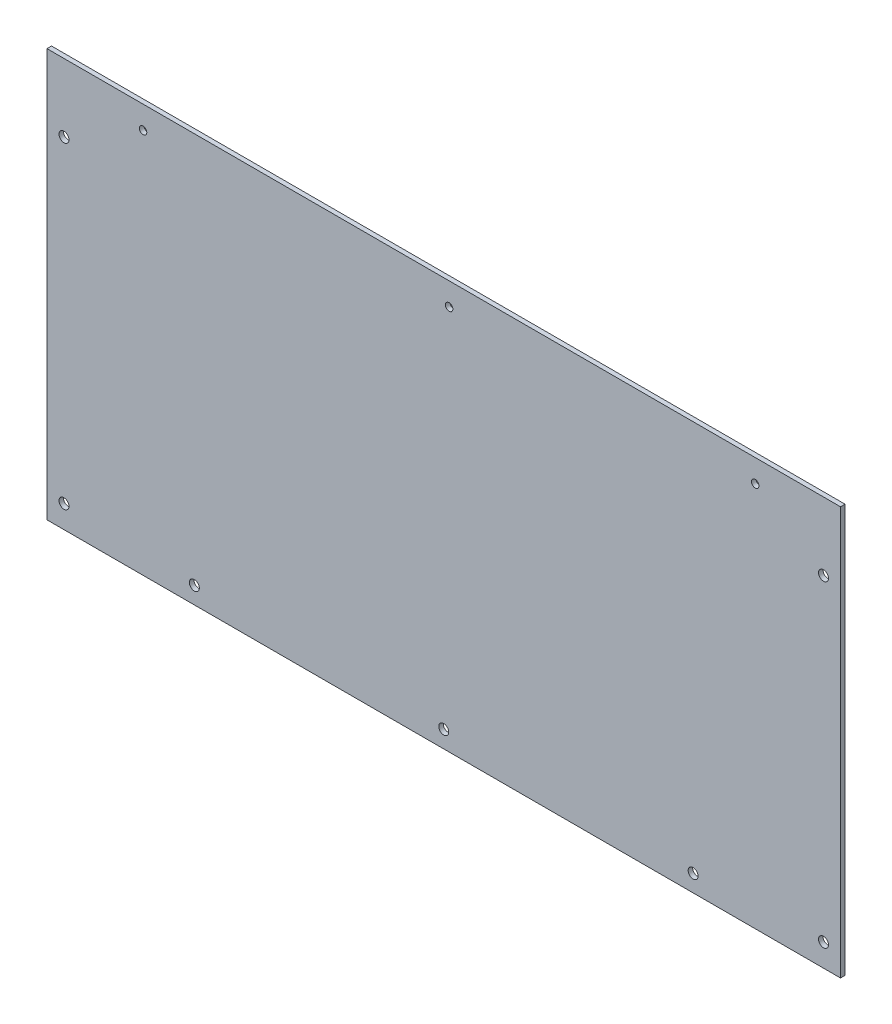
ISO-10303-21;
HEADER;
FILE_DESCRIPTION(('STEP AP214'),'2;1');
FILE_NAME('part.step','',(''),(''),'','','');
FILE_SCHEMA(('AUTOMOTIVE_DESIGN { 1 0 10303 214 1 1 1 1 }'));
ENDSEC;
DATA;
#1=APPLICATION_CONTEXT('core data for automotive mechanical design processes');
#2=APPLICATION_PROTOCOL_DEFINITION('international standard','automotive_design',2000,#1);
#3=PRODUCT_CONTEXT('',#1,'mechanical');
#4=PRODUCT('Part','Part','',(#3));
#5=PRODUCT_RELATED_PRODUCT_CATEGORY('part','',(#4));
#6=PRODUCT_DEFINITION_FORMATION('','',#4);
#7=PRODUCT_DEFINITION_CONTEXT('part definition',#1,'design');
#8=PRODUCT_DEFINITION('design','',#6,#7);
#9=PRODUCT_DEFINITION_SHAPE('','',#8);
#10=(LENGTH_UNIT() NAMED_UNIT(*) SI_UNIT(.MILLI.,.METRE.));
#11=(NAMED_UNIT(*) PLANE_ANGLE_UNIT() SI_UNIT($,.RADIAN.));
#12=(NAMED_UNIT(*) SI_UNIT($,.STERADIAN.) SOLID_ANGLE_UNIT());
#13=UNCERTAINTY_MEASURE_WITH_UNIT(LENGTH_MEASURE(1.E-05),#10,'distance_accuracy_value','');
#14=(GEOMETRIC_REPRESENTATION_CONTEXT(3) GLOBAL_UNCERTAINTY_ASSIGNED_CONTEXT((#13)) GLOBAL_UNIT_ASSIGNED_CONTEXT((#10,
#11,#12)) REPRESENTATION_CONTEXT('',''));
#15=CARTESIAN_POINT('',(0.,0.,0.));
#16=DIRECTION('',(0.,0.,1.));
#17=DIRECTION('',(1.,0.,0.));
#18=AXIS2_PLACEMENT_3D('',#15,#16,#17);
#19=CARTESIAN_POINT('',(175.,90.,2.));
#20=DIRECTION('',(-1.,0.,0.));
#21=DIRECTION('',(0.,-1.,0.));
#22=AXIS2_PLACEMENT_3D('',#19,#20,#21);
#23=PLANE('',#22);
#24=DIRECTION('',(0.,1.,0.));
#25=VECTOR('',#24,1.);
#26=CARTESIAN_POINT('',(175.,90.,0.));
#27=LINE('',#26,#25);
#28=CARTESIAN_POINT('',(175.,-90.,0.));
#29=VERTEX_POINT('',#28);
#30=CARTESIAN_POINT('',(175.,90.,0.));
#31=VERTEX_POINT('',#30);
#32=EDGE_CURVE('E101',#29,#31,#27,.T.);
#33=ORIENTED_EDGE('',*,*,#32,.T.);
#34=DIRECTION('',(0.,0.,-1.));
#35=VECTOR('',#34,1.);
#36=CARTESIAN_POINT('',(175.,90.,2.));
#37=LINE('',#36,#35);
#38=CARTESIAN_POINT('',(175.,90.,2.));
#39=VERTEX_POINT('',#38);
#40=EDGE_CURVE('E11',#39,#31,#37,.T.);
#41=ORIENTED_EDGE('',*,*,#40,.F.);
#42=DIRECTION('',(0.,1.,0.));
#43=VECTOR('',#42,1.);
#44=CARTESIAN_POINT('',(175.,90.,2.));
#45=LINE('',#44,#43);
#46=CARTESIAN_POINT('',(175.,-90.,2.));
#47=VERTEX_POINT('',#46);
#48=EDGE_CURVE('E88',#47,#39,#45,.T.);
#49=ORIENTED_EDGE('',*,*,#48,.F.);
#50=DIRECTION('',(0.,0.,-1.));
#51=VECTOR('',#50,1.);
#52=CARTESIAN_POINT('',(175.,-90.,2.));
#53=LINE('',#52,#51);
#54=EDGE_CURVE('E97',#47,#29,#53,.T.);
#55=ORIENTED_EDGE('',*,*,#54,.T.);
#56=EDGE_LOOP('',(#33,#41,#49,#55));
#57=FACE_BOUND('',#56,.T.);
#58=ADVANCED_FACE('F35',(#57),#23,.F.);
#59=CARTESIAN_POINT('',(-175.,90.,2.));
#60=DIRECTION('',(0.,-1.,0.));
#61=DIRECTION('',(0.,0.,-1.));
#62=AXIS2_PLACEMENT_3D('',#59,#60,#61);
#63=PLANE('',#62);
#64=DIRECTION('',(-1.,0.,0.));
#65=VECTOR('',#64,1.);
#66=CARTESIAN_POINT('',(-175.,90.,0.));
#67=LINE('',#66,#65);
#68=CARTESIAN_POINT('',(-175.,90.,0.));
#69=VERTEX_POINT('',#68);
#70=EDGE_CURVE('E92',#31,#69,#67,.T.);
#71=ORIENTED_EDGE('',*,*,#70,.T.);
#72=DIRECTION('',(0.,0.,-1.));
#73=VECTOR('',#72,1.);
#74=CARTESIAN_POINT('',(-175.,90.,2.));
#75=LINE('',#74,#73);
#76=CARTESIAN_POINT('',(-175.,90.,2.));
#77=VERTEX_POINT('',#76);
#78=EDGE_CURVE('E44',#77,#69,#75,.T.);
#79=ORIENTED_EDGE('',*,*,#78,.F.);
#80=DIRECTION('',(-1.,0.,0.));
#81=VECTOR('',#80,1.);
#82=CARTESIAN_POINT('',(-175.,90.,2.));
#83=LINE('',#82,#81);
#84=EDGE_CURVE('E83',#39,#77,#83,.T.);
#85=ORIENTED_EDGE('',*,*,#84,.F.);
#86=ORIENTED_EDGE('',*,*,#40,.T.);
#87=EDGE_LOOP('',(#71,#79,#85,#86));
#88=FACE_BOUND('',#87,.T.);
#89=ADVANCED_FACE('F91',(#88),#63,.F.);
#90=CARTESIAN_POINT('',(-175.,90.,2.));
#91=DIRECTION('',(1.,0.,0.));
#92=DIRECTION('',(0.,1.,0.));
#93=AXIS2_PLACEMENT_3D('',#90,#91,#92);
#94=PLANE('',#93);
#95=DIRECTION('',(0.,-1.,0.));
#96=VECTOR('',#95,1.);
#97=CARTESIAN_POINT('',(-175.,90.,0.));
#98=LINE('',#97,#96);
#99=CARTESIAN_POINT('',(-175.,-90.,0.));
#100=VERTEX_POINT('',#99);
#101=EDGE_CURVE('E70',#69,#100,#98,.T.);
#102=ORIENTED_EDGE('',*,*,#101,.T.);
#103=DIRECTION('',(0.,0.,-1.));
#104=VECTOR('',#103,1.);
#105=CARTESIAN_POINT('',(-175.,-90.,2.));
#106=LINE('',#105,#104);
#107=CARTESIAN_POINT('',(-175.,-90.,2.));
#108=VERTEX_POINT('',#107);
#109=EDGE_CURVE('E93',#108,#100,#106,.T.);
#110=ORIENTED_EDGE('',*,*,#109,.F.);
#111=DIRECTION('',(0.,-1.,0.));
#112=VECTOR('',#111,1.);
#113=CARTESIAN_POINT('',(-175.,90.,2.));
#114=LINE('',#113,#112);
#115=EDGE_CURVE('E86',#77,#108,#114,.T.);
#116=ORIENTED_EDGE('',*,*,#115,.F.);
#117=ORIENTED_EDGE('',*,*,#78,.T.);
#118=EDGE_LOOP('',(#102,#110,#116,#117));
#119=FACE_BOUND('',#118,.T.);
#120=ADVANCED_FACE('F95',(#119),#94,.F.);
#121=CARTESIAN_POINT('',(-175.,-90.,2.));
#122=DIRECTION('',(0.,1.,0.));
#123=DIRECTION('',(0.,0.,1.));
#124=AXIS2_PLACEMENT_3D('',#121,#122,#123);
#125=PLANE('',#124);
#126=DIRECTION('',(1.,0.,0.));
#127=VECTOR('',#126,1.);
#128=CARTESIAN_POINT('',(-175.,-90.,0.));
#129=LINE('',#128,#127);
#130=EDGE_CURVE('E76',#100,#29,#129,.T.);
#131=ORIENTED_EDGE('',*,*,#130,.T.);
#132=ORIENTED_EDGE('',*,*,#54,.F.);
#133=DIRECTION('',(1.,0.,0.));
#134=VECTOR('',#133,1.);
#135=CARTESIAN_POINT('',(-175.,-90.,2.));
#136=LINE('',#135,#134);
#137=EDGE_CURVE('E53',#108,#47,#136,.T.);
#138=ORIENTED_EDGE('',*,*,#137,.F.);
#139=ORIENTED_EDGE('',*,*,#109,.T.);
#140=EDGE_LOOP('',(#131,#132,#138,#139));
#141=FACE_BOUND('',#140,.T.);
#142=ADVANCED_FACE('F182',(#141),#125,.F.);
#143=CARTESIAN_POINT('',(0.,0.,2.));
#144=DIRECTION('',(0.,0.,1.));
#145=DIRECTION('',(1.,0.,0.));
#146=AXIS2_PLACEMENT_3D('',#143,#144,#145);
#147=PLANE('',#146);
#148=CARTESIAN_POINT('',(-132.62,80.,2.));
#149=DIRECTION('',(0.,0.,1.));
#150=DIRECTION('',(1.,0.,0.));
#151=AXIS2_PLACEMENT_3D('',#148,#149,#150);
#152=CIRCLE('',#151,1.64999999999998);
#153=CARTESIAN_POINT('',(-130.97,80.,2.));
#154=VERTEX_POINT('',#153);
#155=EDGE_CURVE('E173',#154,#154,#152,.T.);
#156=ORIENTED_EDGE('',*,*,#155,.F.);
#157=EDGE_LOOP('',(#156));
#158=FACE_BOUND('',#157,.T.);
#159=CARTESIAN_POINT('',(2.38000000000002,80.,2.));
#160=DIRECTION('',(0.,0.,1.));
#161=DIRECTION('',(1.,0.,0.));
#162=AXIS2_PLACEMENT_3D('',#159,#160,#161);
#163=CIRCLE('',#162,1.64999999999999);
#164=CARTESIAN_POINT('',(4.03000000000001,80.,2.));
#165=VERTEX_POINT('',#164);
#166=EDGE_CURVE('E167',#165,#165,#163,.T.);
#167=ORIENTED_EDGE('',*,*,#166,.F.);
#168=EDGE_LOOP('',(#167));
#169=FACE_BOUND('',#168,.T.);
#170=CARTESIAN_POINT('',(137.38,80.,2.));
#171=DIRECTION('',(0.,0.,1.));
#172=DIRECTION('',(1.,0.,0.));
#173=AXIS2_PLACEMENT_3D('',#170,#171,#172);
#174=CIRCLE('',#173,1.64999999999998);
#175=CARTESIAN_POINT('',(139.03,80.,2.));
#176=VERTEX_POINT('',#175);
#177=EDGE_CURVE('E161',#176,#176,#174,.T.);
#178=ORIENTED_EDGE('',*,*,#177,.F.);
#179=EDGE_LOOP('',(#178));
#180=FACE_BOUND('',#179,.T.);
#181=CARTESIAN_POINT('',(-110.,-82.5,2.));
#182=DIRECTION('',(0.,0.,1.));
#183=DIRECTION('',(1.,0.,0.));
#184=AXIS2_PLACEMENT_3D('',#181,#182,#183);
#185=CIRCLE('',#184,2.2);
#186=CARTESIAN_POINT('',(-107.8,-82.5,2.));
#187=VERTEX_POINT('',#186);
#188=EDGE_CURVE('E125',#187,#187,#185,.T.);
#189=ORIENTED_EDGE('',*,*,#188,.F.);
#190=EDGE_LOOP('',(#189));
#191=FACE_BOUND('',#190,.T.);
#192=CARTESIAN_POINT('',(0.,-82.5,2.));
#193=DIRECTION('',(0.,0.,1.));
#194=DIRECTION('',(1.,0.,0.));
#195=AXIS2_PLACEMENT_3D('',#192,#193,#194);
#196=CIRCLE('',#195,2.2);
#197=CARTESIAN_POINT('',(2.2,-82.5,2.));
#198=VERTEX_POINT('',#197);
#199=EDGE_CURVE('E153',#198,#198,#196,.T.);
#200=ORIENTED_EDGE('',*,*,#199,.F.);
#201=EDGE_LOOP('',(#200));
#202=FACE_BOUND('',#201,.T.);
#203=CARTESIAN_POINT('',(110.,-82.5,2.));
#204=DIRECTION('',(0.,0.,1.));
#205=DIRECTION('',(1.,0.,0.));
#206=AXIS2_PLACEMENT_3D('',#203,#204,#205);
#207=CIRCLE('',#206,2.2);
#208=CARTESIAN_POINT('',(112.2,-82.5,2.));
#209=VERTEX_POINT('',#208);
#210=EDGE_CURVE('E150',#209,#209,#207,.T.);
#211=ORIENTED_EDGE('',*,*,#210,.F.);
#212=EDGE_LOOP('',(#211));
#213=FACE_BOUND('',#212,.T.);
#214=CARTESIAN_POINT('',(167.5,60.,2.));
#215=DIRECTION('',(0.,0.,1.));
#216=DIRECTION('',(1.,0.,0.));
#217=AXIS2_PLACEMENT_3D('',#214,#215,#216);
#218=CIRCLE('',#217,2.20000000000001);
#219=CARTESIAN_POINT('',(169.7,60.,2.));
#220=VERTEX_POINT('',#219);
#221=EDGE_CURVE('E130',#220,#220,#218,.T.);
#222=ORIENTED_EDGE('',*,*,#221,.F.);
#223=EDGE_LOOP('',(#222));
#224=FACE_BOUND('',#223,.T.);
#225=CARTESIAN_POINT('',(167.5,-80.,2.));
#226=DIRECTION('',(0.,0.,1.));
#227=DIRECTION('',(1.,0.,0.));
#228=AXIS2_PLACEMENT_3D('',#225,#226,#227);
#229=CIRCLE('',#228,2.20000000000001);
#230=CARTESIAN_POINT('',(169.7,-80.,2.));
#231=VERTEX_POINT('',#230);
#232=EDGE_CURVE('E134',#231,#231,#229,.T.);
#233=ORIENTED_EDGE('',*,*,#232,.F.);
#234=EDGE_LOOP('',(#233));
#235=FACE_BOUND('',#234,.T.);
#236=CARTESIAN_POINT('',(-167.5,-80.,2.));
#237=DIRECTION('',(0.,0.,1.));
#238=DIRECTION('',(1.,0.,0.));
#239=AXIS2_PLACEMENT_3D('',#236,#237,#238);
#240=CIRCLE('',#239,2.20000000000001);
#241=CARTESIAN_POINT('',(-165.3,-80.,2.));
#242=VERTEX_POINT('',#241);
#243=EDGE_CURVE('E139',#242,#242,#240,.T.);
#244=ORIENTED_EDGE('',*,*,#243,.F.);
#245=EDGE_LOOP('',(#244));
#246=FACE_BOUND('',#245,.T.);
#247=CARTESIAN_POINT('',(-167.5,60.,2.));
#248=DIRECTION('',(0.,0.,1.));
#249=DIRECTION('',(1.,0.,0.));
#250=AXIS2_PLACEMENT_3D('',#247,#248,#249);
#251=CIRCLE('',#250,2.20000000000001);
#252=CARTESIAN_POINT('',(-165.3,60.,2.));
#253=VERTEX_POINT('',#252);
#254=EDGE_CURVE('E114',#253,#253,#251,.T.);
#255=ORIENTED_EDGE('',*,*,#254,.F.);
#256=EDGE_LOOP('',(#255));
#257=FACE_BOUND('',#256,.T.);
#258=ORIENTED_EDGE('',*,*,#48,.T.);
#259=ORIENTED_EDGE('',*,*,#84,.T.);
#260=ORIENTED_EDGE('',*,*,#115,.T.);
#261=ORIENTED_EDGE('',*,*,#137,.T.);
#262=EDGE_LOOP('',(#258,#259,#260,#261));
#263=FACE_BOUND('',#262,.T.);
#264=ADVANCED_FACE('F84',(#158,#169,#180,#191,#202,#213,#224,#235,#246,#257,#263),#147,.T.);
#265=CARTESIAN_POINT('',(0.,0.,0.));
#266=DIRECTION('',(0.,0.,1.));
#267=DIRECTION('',(1.,0.,0.));
#268=AXIS2_PLACEMENT_3D('',#265,#266,#267);
#269=PLANE('',#268);
#270=CARTESIAN_POINT('',(-132.62,80.,0.));
#271=DIRECTION('',(0.,0.,1.));
#272=DIRECTION('',(1.,0.,0.));
#273=AXIS2_PLACEMENT_3D('',#270,#271,#272);
#274=CIRCLE('',#273,1.64999999999998);
#275=CARTESIAN_POINT('',(-130.97,80.,0.));
#276=VERTEX_POINT('',#275);
#277=EDGE_CURVE('E170',#276,#276,#274,.T.);
#278=ORIENTED_EDGE('',*,*,#277,.T.);
#279=EDGE_LOOP('',(#278));
#280=FACE_BOUND('',#279,.T.);
#281=CARTESIAN_POINT('',(2.38000000000002,80.,0.));
#282=DIRECTION('',(0.,0.,1.));
#283=DIRECTION('',(1.,0.,0.));
#284=AXIS2_PLACEMENT_3D('',#281,#282,#283);
#285=CIRCLE('',#284,1.65);
#286=CARTESIAN_POINT('',(4.03000000000002,80.,0.));
#287=VERTEX_POINT('',#286);
#288=EDGE_CURVE('E164',#287,#287,#285,.T.);
#289=ORIENTED_EDGE('',*,*,#288,.T.);
#290=EDGE_LOOP('',(#289));
#291=FACE_BOUND('',#290,.T.);
#292=CARTESIAN_POINT('',(137.38,80.,0.));
#293=DIRECTION('',(0.,0.,1.));
#294=DIRECTION('',(1.,0.,0.));
#295=AXIS2_PLACEMENT_3D('',#292,#293,#294);
#296=CIRCLE('',#295,1.64999999999998);
#297=CARTESIAN_POINT('',(139.03,80.,0.));
#298=VERTEX_POINT('',#297);
#299=EDGE_CURVE('E154',#298,#298,#296,.T.);
#300=ORIENTED_EDGE('',*,*,#299,.T.);
#301=EDGE_LOOP('',(#300));
#302=FACE_BOUND('',#301,.T.);
#303=CARTESIAN_POINT('',(-110.,-82.5,0.));
#304=DIRECTION('',(0.,0.,1.));
#305=DIRECTION('',(1.,0.,0.));
#306=AXIS2_PLACEMENT_3D('',#303,#304,#305);
#307=CIRCLE('',#306,2.2);
#308=CARTESIAN_POINT('',(-107.8,-82.5,0.));
#309=VERTEX_POINT('',#308);
#310=EDGE_CURVE('E38',#309,#309,#307,.T.);
#311=ORIENTED_EDGE('',*,*,#310,.T.);
#312=EDGE_LOOP('',(#311));
#313=FACE_BOUND('',#312,.T.);
#314=CARTESIAN_POINT('',(0.,-82.5,0.));
#315=DIRECTION('',(0.,0.,1.));
#316=DIRECTION('',(1.,0.,0.));
#317=AXIS2_PLACEMENT_3D('',#314,#315,#316);
#318=CIRCLE('',#317,2.2);
#319=CARTESIAN_POINT('',(2.2,-82.5,0.));
#320=VERTEX_POINT('',#319);
#321=EDGE_CURVE('E124',#320,#320,#318,.T.);
#322=ORIENTED_EDGE('',*,*,#321,.T.);
#323=EDGE_LOOP('',(#322));
#324=FACE_BOUND('',#323,.T.);
#325=CARTESIAN_POINT('',(110.,-82.5,0.));
#326=DIRECTION('',(0.,0.,1.));
#327=DIRECTION('',(1.,0.,0.));
#328=AXIS2_PLACEMENT_3D('',#325,#326,#327);
#329=CIRCLE('',#328,2.2);
#330=CARTESIAN_POINT('',(112.2,-82.5,0.));
#331=VERTEX_POINT('',#330);
#332=EDGE_CURVE('E122',#331,#331,#329,.T.);
#333=ORIENTED_EDGE('',*,*,#332,.T.);
#334=EDGE_LOOP('',(#333));
#335=FACE_BOUND('',#334,.T.);
#336=CARTESIAN_POINT('',(167.5,60.,0.));
#337=DIRECTION('',(0.,0.,1.));
#338=DIRECTION('',(1.,0.,0.));
#339=AXIS2_PLACEMENT_3D('',#336,#337,#338);
#340=CIRCLE('',#339,2.20000000000001);
#341=CARTESIAN_POINT('',(169.7,60.,0.));
#342=VERTEX_POINT('',#341);
#343=EDGE_CURVE('E104',#342,#342,#340,.T.);
#344=ORIENTED_EDGE('',*,*,#343,.T.);
#345=EDGE_LOOP('',(#344));
#346=FACE_BOUND('',#345,.T.);
#347=CARTESIAN_POINT('',(167.5,-80.,0.));
#348=DIRECTION('',(0.,0.,1.));
#349=DIRECTION('',(1.,0.,0.));
#350=AXIS2_PLACEMENT_3D('',#347,#348,#349);
#351=CIRCLE('',#350,2.20000000000001);
#352=CARTESIAN_POINT('',(169.7,-80.,0.));
#353=VERTEX_POINT('',#352);
#354=EDGE_CURVE('E117',#353,#353,#351,.T.);
#355=ORIENTED_EDGE('',*,*,#354,.T.);
#356=EDGE_LOOP('',(#355));
#357=FACE_BOUND('',#356,.T.);
#358=CARTESIAN_POINT('',(-167.5,-80.,0.));
#359=DIRECTION('',(0.,0.,1.));
#360=DIRECTION('',(1.,0.,0.));
#361=AXIS2_PLACEMENT_3D('',#358,#359,#360);
#362=CIRCLE('',#361,2.20000000000001);
#363=CARTESIAN_POINT('',(-165.3,-80.,0.));
#364=VERTEX_POINT('',#363);
#365=EDGE_CURVE('E113',#364,#364,#362,.T.);
#366=ORIENTED_EDGE('',*,*,#365,.T.);
#367=EDGE_LOOP('',(#366));
#368=FACE_BOUND('',#367,.T.);
#369=CARTESIAN_POINT('',(-167.5,60.,0.));
#370=DIRECTION('',(0.,0.,1.));
#371=DIRECTION('',(1.,0.,0.));
#372=AXIS2_PLACEMENT_3D('',#369,#370,#371);
#373=CIRCLE('',#372,2.20000000000001);
#374=CARTESIAN_POINT('',(-165.3,60.,0.));
#375=VERTEX_POINT('',#374);
#376=EDGE_CURVE('E110',#375,#375,#373,.T.);
#377=ORIENTED_EDGE('',*,*,#376,.T.);
#378=EDGE_LOOP('',(#377));
#379=FACE_BOUND('',#378,.T.);
#380=ORIENTED_EDGE('',*,*,#32,.F.);
#381=ORIENTED_EDGE('',*,*,#130,.F.);
#382=ORIENTED_EDGE('',*,*,#101,.F.);
#383=ORIENTED_EDGE('',*,*,#70,.F.);
#384=EDGE_LOOP('',(#380,#381,#382,#383));
#385=FACE_BOUND('',#384,.T.);
#386=ADVANCED_FACE('F181',(#280,#291,#302,#313,#324,#335,#346,#357,#368,#379,#385),#269,.F.);
#387=CARTESIAN_POINT('',(-167.5,60.,-158.));
#388=DIRECTION('',(0.,0.,1.));
#389=DIRECTION('',(1.,0.,0.));
#390=AXIS2_PLACEMENT_3D('',#387,#388,#389);
#391=CYLINDRICAL_SURFACE('',#390,2.20000000000001);
#392=ORIENTED_EDGE('',*,*,#254,.T.);
#393=EDGE_LOOP('',(#392));
#394=FACE_BOUND('',#393,.T.);
#395=ORIENTED_EDGE('',*,*,#376,.F.);
#396=EDGE_LOOP('',(#395));
#397=FACE_BOUND('',#396,.T.);
#398=ADVANCED_FACE('F209',(#394,#397),#391,.F.);
#399=CARTESIAN_POINT('',(-167.5,-80.,-158.));
#400=DIRECTION('',(0.,0.,1.));
#401=DIRECTION('',(1.,0.,0.));
#402=AXIS2_PLACEMENT_3D('',#399,#400,#401);
#403=CYLINDRICAL_SURFACE('',#402,2.20000000000001);
#404=ORIENTED_EDGE('',*,*,#243,.T.);
#405=EDGE_LOOP('',(#404));
#406=FACE_BOUND('',#405,.T.);
#407=ORIENTED_EDGE('',*,*,#365,.F.);
#408=EDGE_LOOP('',(#407));
#409=FACE_BOUND('',#408,.T.);
#410=ADVANCED_FACE('F203',(#406,#409),#403,.F.);
#411=CARTESIAN_POINT('',(167.5,-80.,-158.));
#412=DIRECTION('',(0.,0.,1.));
#413=DIRECTION('',(1.,0.,0.));
#414=AXIS2_PLACEMENT_3D('',#411,#412,#413);
#415=CYLINDRICAL_SURFACE('',#414,2.20000000000001);
#416=ORIENTED_EDGE('',*,*,#232,.T.);
#417=EDGE_LOOP('',(#416));
#418=FACE_BOUND('',#417,.T.);
#419=ORIENTED_EDGE('',*,*,#354,.F.);
#420=EDGE_LOOP('',(#419));
#421=FACE_BOUND('',#420,.T.);
#422=ADVANCED_FACE('F199',(#418,#421),#415,.F.);
#423=CARTESIAN_POINT('',(167.5,60.,-158.));
#424=DIRECTION('',(0.,0.,1.));
#425=DIRECTION('',(1.,0.,0.));
#426=AXIS2_PLACEMENT_3D('',#423,#424,#425);
#427=CYLINDRICAL_SURFACE('',#426,2.20000000000001);
#428=ORIENTED_EDGE('',*,*,#221,.T.);
#429=EDGE_LOOP('',(#428));
#430=FACE_BOUND('',#429,.T.);
#431=ORIENTED_EDGE('',*,*,#343,.F.);
#432=EDGE_LOOP('',(#431));
#433=FACE_BOUND('',#432,.T.);
#434=ADVANCED_FACE('F202',(#430,#433),#427,.F.);
#435=CARTESIAN_POINT('',(110.,-82.5,-158.));
#436=DIRECTION('',(0.,0.,1.));
#437=DIRECTION('',(1.,0.,0.));
#438=AXIS2_PLACEMENT_3D('',#435,#436,#437);
#439=CYLINDRICAL_SURFACE('',#438,2.2);
#440=ORIENTED_EDGE('',*,*,#210,.T.);
#441=EDGE_LOOP('',(#440));
#442=FACE_BOUND('',#441,.T.);
#443=ORIENTED_EDGE('',*,*,#332,.F.);
#444=EDGE_LOOP('',(#443));
#445=FACE_BOUND('',#444,.T.);
#446=ADVANCED_FACE('F271',(#442,#445),#439,.F.);
#447=CARTESIAN_POINT('',(0.,-82.5,-158.));
#448=DIRECTION('',(0.,0.,1.));
#449=DIRECTION('',(1.,0.,0.));
#450=AXIS2_PLACEMENT_3D('',#447,#448,#449);
#451=CYLINDRICAL_SURFACE('',#450,2.2);
#452=ORIENTED_EDGE('',*,*,#199,.T.);
#453=EDGE_LOOP('',(#452));
#454=FACE_BOUND('',#453,.T.);
#455=ORIENTED_EDGE('',*,*,#321,.F.);
#456=EDGE_LOOP('',(#455));
#457=FACE_BOUND('',#456,.T.);
#458=ADVANCED_FACE('F280',(#454,#457),#451,.F.);
#459=CARTESIAN_POINT('',(-110.,-82.5,-158.));
#460=DIRECTION('',(0.,0.,1.));
#461=DIRECTION('',(1.,0.,0.));
#462=AXIS2_PLACEMENT_3D('',#459,#460,#461);
#463=CYLINDRICAL_SURFACE('',#462,2.2);
#464=ORIENTED_EDGE('',*,*,#188,.T.);
#465=EDGE_LOOP('',(#464));
#466=FACE_BOUND('',#465,.T.);
#467=ORIENTED_EDGE('',*,*,#310,.F.);
#468=EDGE_LOOP('',(#467));
#469=FACE_BOUND('',#468,.T.);
#470=ADVANCED_FACE('F290',(#466,#469),#463,.F.);
#471=CARTESIAN_POINT('',(137.38,80.,2.));
#472=DIRECTION('',(0.,0.,1.));
#473=DIRECTION('',(1.,0.,0.));
#474=AXIS2_PLACEMENT_3D('',#471,#472,#473);
#475=CYLINDRICAL_SURFACE('',#474,1.64999999999998);
#476=ORIENTED_EDGE('',*,*,#299,.F.);
#477=EDGE_LOOP('',(#476));
#478=FACE_BOUND('',#477,.T.);
#479=ORIENTED_EDGE('',*,*,#177,.T.);
#480=EDGE_LOOP('',(#479));
#481=FACE_BOUND('',#480,.T.);
#482=ADVANCED_FACE('F300',(#478,#481),#475,.F.);
#483=CARTESIAN_POINT('',(2.38000000000002,80.,2.));
#484=DIRECTION('',(0.,0.,1.));
#485=DIRECTION('',(1.,0.,0.));
#486=AXIS2_PLACEMENT_3D('',#483,#484,#485);
#487=CYLINDRICAL_SURFACE('',#486,1.64999999999999);
#488=ORIENTED_EDGE('',*,*,#288,.F.);
#489=EDGE_LOOP('',(#488));
#490=FACE_BOUND('',#489,.T.);
#491=ORIENTED_EDGE('',*,*,#166,.T.);
#492=EDGE_LOOP('',(#491));
#493=FACE_BOUND('',#492,.T.);
#494=ADVANCED_FACE('F321',(#490,#493),#487,.F.);
#495=CARTESIAN_POINT('',(-132.62,80.,2.));
#496=DIRECTION('',(0.,0.,1.));
#497=DIRECTION('',(1.,0.,0.));
#498=AXIS2_PLACEMENT_3D('',#495,#496,#497);
#499=CYLINDRICAL_SURFACE('',#498,1.64999999999998);
#500=ORIENTED_EDGE('',*,*,#277,.F.);
#501=EDGE_LOOP('',(#500));
#502=FACE_BOUND('',#501,.T.);
#503=ORIENTED_EDGE('',*,*,#155,.T.);
#504=EDGE_LOOP('',(#503));
#505=FACE_BOUND('',#504,.T.);
#506=ADVANCED_FACE('F177',(#502,#505),#499,.F.);
#507=CLOSED_SHELL('',(#58,#89,#120,#142,#264,#386,#398,#410,#422,#434,#446,#458,#470,#482,#494,#506));
#508=MANIFOLD_SOLID_BREP('B2',#507);
#509=ADVANCED_BREP_SHAPE_REPRESENTATION('',(#18,#508),#14);
#510=SHAPE_DEFINITION_REPRESENTATION(#9,#509);
ENDSEC;
END-ISO-10303-21;
